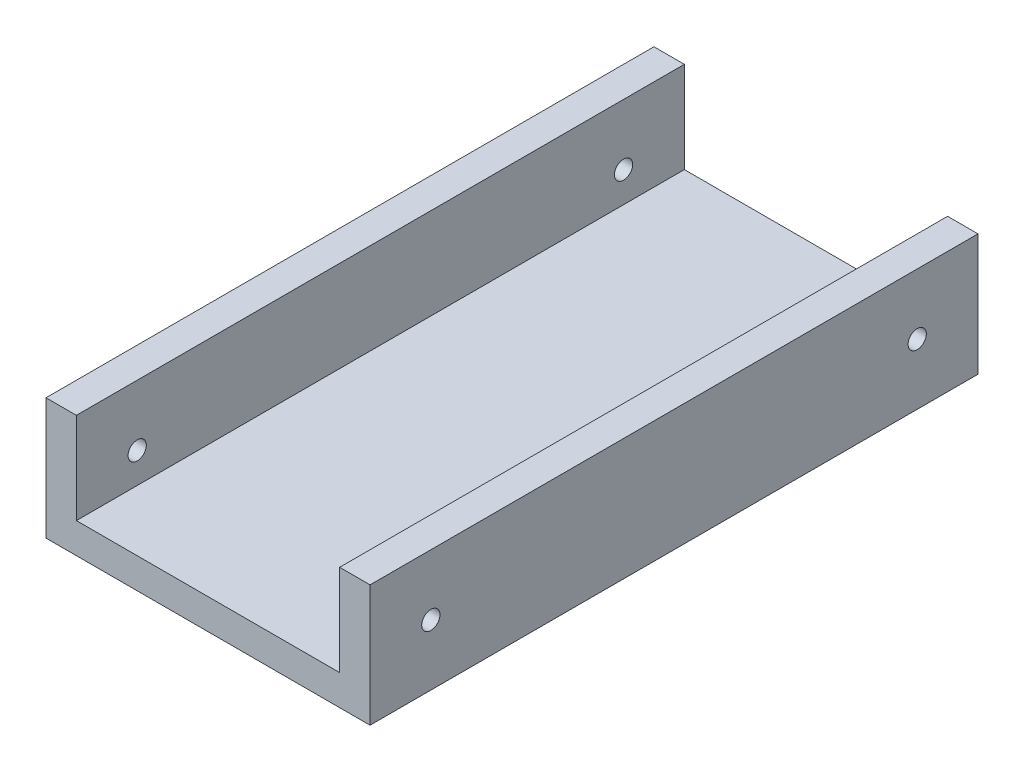
ISO-10303-21;
HEADER;
FILE_DESCRIPTION(('STEP AP214'),'2;1');
FILE_NAME('part.step','',(''),(''),'','','');
FILE_SCHEMA(('AUTOMOTIVE_DESIGN { 1 0 10303 214 1 1 1 1 }'));
ENDSEC;
DATA;
#1=APPLICATION_CONTEXT('core data for automotive mechanical design processes');
#2=APPLICATION_PROTOCOL_DEFINITION('international standard','automotive_design',2000,#1);
#3=PRODUCT_CONTEXT('',#1,'mechanical');
#4=PRODUCT('Part','Part','',(#3));
#5=PRODUCT_RELATED_PRODUCT_CATEGORY('part','',(#4));
#6=PRODUCT_DEFINITION_FORMATION('','',#4);
#7=PRODUCT_DEFINITION_CONTEXT('part definition',#1,'design');
#8=PRODUCT_DEFINITION('design','',#6,#7);
#9=PRODUCT_DEFINITION_SHAPE('','',#8);
#10=(LENGTH_UNIT() NAMED_UNIT(*) SI_UNIT(.MILLI.,.METRE.));
#11=(NAMED_UNIT(*) PLANE_ANGLE_UNIT() SI_UNIT($,.RADIAN.));
#12=(NAMED_UNIT(*) SI_UNIT($,.STERADIAN.) SOLID_ANGLE_UNIT());
#13=UNCERTAINTY_MEASURE_WITH_UNIT(LENGTH_MEASURE(1.E-05),#10,'distance_accuracy_value','');
#14=(GEOMETRIC_REPRESENTATION_CONTEXT(3) GLOBAL_UNCERTAINTY_ASSIGNED_CONTEXT((#13)) GLOBAL_UNIT_ASSIGNED_CONTEXT((#10,
#11,#12)) REPRESENTATION_CONTEXT('',''));
#15=CARTESIAN_POINT('',(0.,0.,0.));
#16=DIRECTION('',(0.,0.,1.));
#17=DIRECTION('',(1.,0.,0.));
#18=AXIS2_PLACEMENT_3D('',#15,#16,#17);
#19=CARTESIAN_POINT('',(0.,20.,0.));
#20=DIRECTION('',(0.,1.,0.));
#21=DIRECTION('',(0.,0.,1.));
#22=AXIS2_PLACEMENT_3D('',#19,#20,#21);
#23=PLANE('',#22);
#24=DIRECTION('',(0.,0.,1.));
#25=VECTOR('',#24,1.);
#26=CARTESIAN_POINT('',(5.,20.,0.));
#27=LINE('',#26,#25);
#28=CARTESIAN_POINT('',(5.,20.,0.));
#29=VERTEX_POINT('',#28);
#30=CARTESIAN_POINT('',(5.00000000000001,20.,100.));
#31=VERTEX_POINT('',#30);
#32=EDGE_CURVE('E122',#29,#31,#27,.T.);
#33=ORIENTED_EDGE('',*,*,#32,.F.);
#34=DIRECTION('',(-1.,0.,0.));
#35=VECTOR('',#34,1.);
#36=CARTESIAN_POINT('',(0.,20.,0.));
#37=LINE('',#36,#35);
#38=CARTESIAN_POINT('',(0.,20.,0.));
#39=VERTEX_POINT('',#38);
#40=EDGE_CURVE('E67',#29,#39,#37,.T.);
#41=ORIENTED_EDGE('',*,*,#40,.T.);
#42=DIRECTION('',(0.,0.,1.));
#43=VECTOR('',#42,1.);
#44=CARTESIAN_POINT('',(0.,20.,0.));
#45=LINE('',#44,#43);
#46=CARTESIAN_POINT('',(0.,20.,100.));
#47=VERTEX_POINT('',#46);
#48=EDGE_CURVE('E153',#39,#47,#45,.T.);
#49=ORIENTED_EDGE('',*,*,#48,.T.);
#50=DIRECTION('',(1.,0.,0.));
#51=VECTOR('',#50,1.);
#52=CARTESIAN_POINT('',(0.,20.,100.));
#53=LINE('',#52,#51);
#54=EDGE_CURVE('E96',#47,#31,#53,.T.);
#55=ORIENTED_EDGE('',*,*,#54,.T.);
#56=EDGE_LOOP('',(#33,#41,#49,#55));
#57=FACE_BOUND('',#56,.T.);
#58=ADVANCED_FACE('F41',(#57),#23,.T.);
#59=CARTESIAN_POINT('',(0.,20.,0.));
#60=DIRECTION('',(1.,0.,0.));
#61=DIRECTION('',(0.,0.,-1.));
#62=AXIS2_PLACEMENT_3D('',#59,#60,#61);
#63=PLANE('',#62);
#64=CARTESIAN_POINT('',(0.,10.,90.0000000000001));
#65=DIRECTION('',(1.,0.,0.));
#66=DIRECTION('',(0.,0.,-1.));
#67=AXIS2_PLACEMENT_3D('',#64,#65,#66);
#68=CIRCLE('',#67,1.5);
#69=CARTESIAN_POINT('',(0.,10.,88.5000000000001));
#70=VERTEX_POINT('',#69);
#71=EDGE_CURVE('E177',#70,#70,#68,.T.);
#72=ORIENTED_EDGE('',*,*,#71,.T.);
#73=EDGE_LOOP('',(#72));
#74=FACE_BOUND('',#73,.T.);
#75=CARTESIAN_POINT('',(0.,10.,10.));
#76=DIRECTION('',(1.,0.,0.));
#77=DIRECTION('',(0.,0.,1.));
#78=AXIS2_PLACEMENT_3D('',#75,#76,#77);
#79=CIRCLE('',#78,1.5);
#80=CARTESIAN_POINT('',(0.,10.,11.5));
#81=VERTEX_POINT('',#80);
#82=EDGE_CURVE('E193',#81,#81,#79,.T.);
#83=ORIENTED_EDGE('',*,*,#82,.T.);
#84=EDGE_LOOP('',(#83));
#85=FACE_BOUND('',#84,.T.);
#86=DIRECTION('',(0.,0.,1.));
#87=VECTOR('',#86,1.);
#88=CARTESIAN_POINT('',(0.,0.,0.));
#89=LINE('',#88,#87);
#90=CARTESIAN_POINT('',(0.,0.,0.));
#91=VERTEX_POINT('',#90);
#92=CARTESIAN_POINT('',(0.,0.,100.));
#93=VERTEX_POINT('',#92);
#94=EDGE_CURVE('E148',#91,#93,#89,.T.);
#95=ORIENTED_EDGE('',*,*,#94,.T.);
#96=DIRECTION('',(0.,-1.,0.));
#97=VECTOR('',#96,1.);
#98=CARTESIAN_POINT('',(0.,20.,100.));
#99=LINE('',#98,#97);
#100=EDGE_CURVE('E11',#47,#93,#99,.T.);
#101=ORIENTED_EDGE('',*,*,#100,.F.);
#102=ORIENTED_EDGE('',*,*,#48,.F.);
#103=DIRECTION('',(0.,-1.,0.));
#104=VECTOR('',#103,1.);
#105=CARTESIAN_POINT('',(0.,20.,0.));
#106=LINE('',#105,#104);
#107=EDGE_CURVE('E162',#39,#91,#106,.T.);
#108=ORIENTED_EDGE('',*,*,#107,.T.);
#109=EDGE_LOOP('',(#95,#101,#102,#108));
#110=FACE_BOUND('',#109,.T.);
#111=ADVANCED_FACE('F43',(#74,#85,#110),#63,.F.);
#112=CARTESIAN_POINT('',(0.,20.,100.));
#113=DIRECTION('',(0.,0.,-1.));
#114=DIRECTION('',(-1.,0.,0.));
#115=AXIS2_PLACEMENT_3D('',#112,#113,#114);
#116=PLANE('',#115);
#117=DIRECTION('',(1.,0.,0.));
#118=VECTOR('',#117,1.);
#119=CARTESIAN_POINT('',(5.00000000000001,5.,100.));
#120=LINE('',#119,#118);
#121=CARTESIAN_POINT('',(5.00000000000001,5.,100.));
#122=VERTEX_POINT('',#121);
#123=CARTESIAN_POINT('',(48.3,5.,100.));
#124=VERTEX_POINT('',#123);
#125=EDGE_CURVE('E130',#122,#124,#120,.T.);
#126=ORIENTED_EDGE('',*,*,#125,.F.);
#127=DIRECTION('',(0.,1.,0.));
#128=VECTOR('',#127,1.);
#129=CARTESIAN_POINT('',(5.00000000000001,5.,100.));
#130=LINE('',#129,#128);
#131=EDGE_CURVE('E117',#122,#31,#130,.T.);
#132=ORIENTED_EDGE('',*,*,#131,.T.);
#133=ORIENTED_EDGE('',*,*,#54,.F.);
#134=ORIENTED_EDGE('',*,*,#100,.T.);
#135=DIRECTION('',(1.,0.,0.));
#136=VECTOR('',#135,1.);
#137=CARTESIAN_POINT('',(0.,0.,100.));
#138=LINE('',#137,#136);
#139=CARTESIAN_POINT('',(53.3,0.,100.));
#140=VERTEX_POINT('',#139);
#141=EDGE_CURVE('E165',#93,#140,#138,.T.);
#142=ORIENTED_EDGE('',*,*,#141,.T.);
#143=DIRECTION('',(0.,-1.,0.));
#144=VECTOR('',#143,1.);
#145=CARTESIAN_POINT('',(53.3,20.,100.));
#146=LINE('',#145,#144);
#147=CARTESIAN_POINT('',(53.3,20.,100.));
#148=VERTEX_POINT('',#147);
#149=EDGE_CURVE('E50',#148,#140,#146,.T.);
#150=ORIENTED_EDGE('',*,*,#149,.F.);
#151=CARTESIAN_POINT('',(48.3,20.,100.));
#152=VERTEX_POINT('',#151);
#153=EDGE_CURVE('E155',#152,#148,#53,.T.);
#154=ORIENTED_EDGE('',*,*,#153,.F.);
#155=DIRECTION('',(0.,1.,0.));
#156=VECTOR('',#155,1.);
#157=CARTESIAN_POINT('',(48.3,5.,100.));
#158=LINE('',#157,#156);
#159=EDGE_CURVE('E58',#124,#152,#158,.T.);
#160=ORIENTED_EDGE('',*,*,#159,.F.);
#161=EDGE_LOOP('',(#126,#132,#133,#134,#142,#150,#154,#160));
#162=FACE_BOUND('',#161,.T.);
#163=ADVANCED_FACE('F135',(#162),#116,.F.);
#164=CARTESIAN_POINT('',(53.3,20.,0.));
#165=DIRECTION('',(-1.,0.,0.));
#166=DIRECTION('',(0.,0.,1.));
#167=AXIS2_PLACEMENT_3D('',#164,#165,#166);
#168=PLANE('',#167);
#169=CARTESIAN_POINT('',(53.3,10.,90.));
#170=DIRECTION('',(1.,0.,0.));
#171=DIRECTION('',(0.,0.,-1.));
#172=AXIS2_PLACEMENT_3D('',#169,#170,#171);
#173=CIRCLE('',#172,1.5);
#174=CARTESIAN_POINT('',(53.3,10.,88.5));
#175=VERTEX_POINT('',#174);
#176=EDGE_CURVE('E183',#175,#175,#173,.T.);
#177=ORIENTED_EDGE('',*,*,#176,.F.);
#178=EDGE_LOOP('',(#177));
#179=FACE_BOUND('',#178,.T.);
#180=CARTESIAN_POINT('',(53.3,10.,10.));
#181=DIRECTION('',(1.,0.,0.));
#182=DIRECTION('',(0.,0.,1.));
#183=AXIS2_PLACEMENT_3D('',#180,#181,#182);
#184=CIRCLE('',#183,1.5);
#185=CARTESIAN_POINT('',(53.3,10.,11.5));
#186=VERTEX_POINT('',#185);
#187=EDGE_CURVE('E188',#186,#186,#184,.T.);
#188=ORIENTED_EDGE('',*,*,#187,.F.);
#189=EDGE_LOOP('',(#188));
#190=FACE_BOUND('',#189,.T.);
#191=DIRECTION('',(0.,0.,-1.));
#192=VECTOR('',#191,1.);
#193=CARTESIAN_POINT('',(53.3,0.,0.));
#194=LINE('',#193,#192);
#195=CARTESIAN_POINT('',(53.3,0.,0.));
#196=VERTEX_POINT('',#195);
#197=EDGE_CURVE('E167',#140,#196,#194,.T.);
#198=ORIENTED_EDGE('',*,*,#197,.T.);
#199=DIRECTION('',(0.,-1.,0.));
#200=VECTOR('',#199,1.);
#201=CARTESIAN_POINT('',(53.3,20.,0.));
#202=LINE('',#201,#200);
#203=CARTESIAN_POINT('',(53.3,20.,0.));
#204=VERTEX_POINT('',#203);
#205=EDGE_CURVE('E171',#204,#196,#202,.T.);
#206=ORIENTED_EDGE('',*,*,#205,.F.);
#207=DIRECTION('',(0.,0.,-1.));
#208=VECTOR('',#207,1.);
#209=CARTESIAN_POINT('',(53.3,20.,0.));
#210=LINE('',#209,#208);
#211=EDGE_CURVE('E157',#148,#204,#210,.T.);
#212=ORIENTED_EDGE('',*,*,#211,.F.);
#213=ORIENTED_EDGE('',*,*,#149,.T.);
#214=EDGE_LOOP('',(#198,#206,#212,#213));
#215=FACE_BOUND('',#214,.T.);
#216=ADVANCED_FACE('F238',(#179,#190,#215),#168,.F.);
#217=CARTESIAN_POINT('',(0.,20.,0.));
#218=DIRECTION('',(0.,0.,1.));
#219=DIRECTION('',(1.,0.,0.));
#220=AXIS2_PLACEMENT_3D('',#217,#218,#219);
#221=PLANE('',#220);
#222=ORIENTED_EDGE('',*,*,#40,.F.);
#223=DIRECTION('',(0.,1.,0.));
#224=VECTOR('',#223,1.);
#225=CARTESIAN_POINT('',(5.,5.,0.));
#226=LINE('',#225,#224);
#227=CARTESIAN_POINT('',(5.,5.,0.));
#228=VERTEX_POINT('',#227);
#229=EDGE_CURVE('E146',#228,#29,#226,.T.);
#230=ORIENTED_EDGE('',*,*,#229,.F.);
#231=DIRECTION('',(-1.,0.,0.));
#232=VECTOR('',#231,1.);
#233=CARTESIAN_POINT('',(5.,5.,0.));
#234=LINE('',#233,#232);
#235=CARTESIAN_POINT('',(48.3,5.,0.));
#236=VERTEX_POINT('',#235);
#237=EDGE_CURVE('E124',#236,#228,#234,.T.);
#238=ORIENTED_EDGE('',*,*,#237,.F.);
#239=DIRECTION('',(0.,1.,0.));
#240=VECTOR('',#239,1.);
#241=CARTESIAN_POINT('',(48.3,5.,0.));
#242=LINE('',#241,#240);
#243=CARTESIAN_POINT('',(48.3,20.,0.));
#244=VERTEX_POINT('',#243);
#245=EDGE_CURVE('E149',#236,#244,#242,.T.);
#246=ORIENTED_EDGE('',*,*,#245,.T.);
#247=EDGE_CURVE('E159',#204,#244,#37,.T.);
#248=ORIENTED_EDGE('',*,*,#247,.F.);
#249=ORIENTED_EDGE('',*,*,#205,.T.);
#250=DIRECTION('',(-1.,0.,0.));
#251=VECTOR('',#250,1.);
#252=CARTESIAN_POINT('',(0.,0.,0.));
#253=LINE('',#252,#251);
#254=EDGE_CURVE('E89',#196,#91,#253,.T.);
#255=ORIENTED_EDGE('',*,*,#254,.T.);
#256=ORIENTED_EDGE('',*,*,#107,.F.);
#257=EDGE_LOOP('',(#222,#230,#238,#246,#248,#249,#255,#256));
#258=FACE_BOUND('',#257,.T.);
#259=ADVANCED_FACE('F231',(#258),#221,.F.);
#260=DIRECTION('',(0.,0.,-1.));
#261=VECTOR('',#260,1.);
#262=CARTESIAN_POINT('',(48.3,20.,0.));
#263=LINE('',#262,#261);
#264=EDGE_CURVE('E133',#152,#244,#263,.T.);
#265=ORIENTED_EDGE('',*,*,#264,.F.);
#266=ORIENTED_EDGE('',*,*,#153,.T.);
#267=ORIENTED_EDGE('',*,*,#211,.T.);
#268=ORIENTED_EDGE('',*,*,#247,.T.);
#269=EDGE_LOOP('',(#265,#266,#267,#268));
#270=FACE_BOUND('',#269,.T.);
#271=ADVANCED_FACE('F221',(#270),#23,.T.);
#272=CARTESIAN_POINT('',(0.,0.,0.));
#273=DIRECTION('',(0.,1.,0.));
#274=DIRECTION('',(0.,0.,1.));
#275=AXIS2_PLACEMENT_3D('',#272,#273,#274);
#276=PLANE('',#275);
#277=ORIENTED_EDGE('',*,*,#94,.F.);
#278=ORIENTED_EDGE('',*,*,#254,.F.);
#279=ORIENTED_EDGE('',*,*,#197,.F.);
#280=ORIENTED_EDGE('',*,*,#141,.F.);
#281=EDGE_LOOP('',(#277,#278,#279,#280));
#282=FACE_BOUND('',#281,.T.);
#283=ADVANCED_FACE('F230',(#282),#276,.F.);
#284=CARTESIAN_POINT('',(5.,5.,0.));
#285=DIRECTION('',(-1.,0.,0.));
#286=DIRECTION('',(0.,0.,1.));
#287=AXIS2_PLACEMENT_3D('',#284,#285,#286);
#288=PLANE('',#287);
#289=CARTESIAN_POINT('',(5.00000000000001,10.,90.0000000000001));
#290=DIRECTION('',(-1.,0.,0.));
#291=DIRECTION('',(0.,0.,1.));
#292=AXIS2_PLACEMENT_3D('',#289,#290,#291);
#293=CIRCLE('',#292,1.5);
#294=CARTESIAN_POINT('',(5.00000000000001,10.,91.5000000000001));
#295=VERTEX_POINT('',#294);
#296=EDGE_CURVE('E144',#295,#295,#293,.T.);
#297=ORIENTED_EDGE('',*,*,#296,.T.);
#298=EDGE_LOOP('',(#297));
#299=FACE_BOUND('',#298,.T.);
#300=CARTESIAN_POINT('',(5.,10.,10.));
#301=DIRECTION('',(-1.,0.,0.));
#302=DIRECTION('',(0.,0.,1.));
#303=AXIS2_PLACEMENT_3D('',#300,#301,#302);
#304=CIRCLE('',#303,1.5);
#305=CARTESIAN_POINT('',(5.,10.,11.5));
#306=VERTEX_POINT('',#305);
#307=EDGE_CURVE('E176',#306,#306,#304,.T.);
#308=ORIENTED_EDGE('',*,*,#307,.T.);
#309=EDGE_LOOP('',(#308));
#310=FACE_BOUND('',#309,.T.);
#311=ORIENTED_EDGE('',*,*,#32,.T.);
#312=ORIENTED_EDGE('',*,*,#131,.F.);
#313=DIRECTION('',(0.,0.,1.));
#314=VECTOR('',#313,1.);
#315=CARTESIAN_POINT('',(5.,5.,0.));
#316=LINE('',#315,#314);
#317=EDGE_CURVE('E120',#228,#122,#316,.T.);
#318=ORIENTED_EDGE('',*,*,#317,.F.);
#319=ORIENTED_EDGE('',*,*,#229,.T.);
#320=EDGE_LOOP('',(#311,#312,#318,#319));
#321=FACE_BOUND('',#320,.T.);
#322=ADVANCED_FACE('F119',(#299,#310,#321),#288,.F.);
#323=CARTESIAN_POINT('',(48.3,5.,0.));
#324=DIRECTION('',(1.,0.,0.));
#325=DIRECTION('',(0.,0.,-1.));
#326=AXIS2_PLACEMENT_3D('',#323,#324,#325);
#327=PLANE('',#326);
#328=CARTESIAN_POINT('',(48.3,10.,90.));
#329=DIRECTION('',(1.,0.,0.));
#330=DIRECTION('',(0.,0.,-1.));
#331=AXIS2_PLACEMENT_3D('',#328,#329,#330);
#332=CIRCLE('',#331,1.5);
#333=CARTESIAN_POINT('',(48.3,10.,88.5));
#334=VERTEX_POINT('',#333);
#335=EDGE_CURVE('E45',#334,#334,#332,.T.);
#336=ORIENTED_EDGE('',*,*,#335,.T.);
#337=EDGE_LOOP('',(#336));
#338=FACE_BOUND('',#337,.T.);
#339=CARTESIAN_POINT('',(48.3,10.,10.));
#340=DIRECTION('',(1.,0.,0.));
#341=DIRECTION('',(0.,0.,-1.));
#342=AXIS2_PLACEMENT_3D('',#339,#340,#341);
#343=CIRCLE('',#342,1.5);
#344=CARTESIAN_POINT('',(48.3,10.,8.50000000000001));
#345=VERTEX_POINT('',#344);
#346=EDGE_CURVE('E174',#345,#345,#343,.T.);
#347=ORIENTED_EDGE('',*,*,#346,.T.);
#348=EDGE_LOOP('',(#347));
#349=FACE_BOUND('',#348,.T.);
#350=ORIENTED_EDGE('',*,*,#264,.T.);
#351=ORIENTED_EDGE('',*,*,#245,.F.);
#352=DIRECTION('',(0.,0.,-1.));
#353=VECTOR('',#352,1.);
#354=CARTESIAN_POINT('',(48.3,5.,0.));
#355=LINE('',#354,#353);
#356=EDGE_CURVE('E137',#124,#236,#355,.T.);
#357=ORIENTED_EDGE('',*,*,#356,.F.);
#358=ORIENTED_EDGE('',*,*,#159,.T.);
#359=EDGE_LOOP('',(#350,#351,#357,#358));
#360=FACE_BOUND('',#359,.T.);
#361=ADVANCED_FACE('F201',(#338,#349,#360),#327,.F.);
#362=CARTESIAN_POINT('',(0.,5.,0.));
#363=DIRECTION('',(0.,1.,0.));
#364=DIRECTION('',(0.,0.,1.));
#365=AXIS2_PLACEMENT_3D('',#362,#363,#364);
#366=PLANE('',#365);
#367=ORIENTED_EDGE('',*,*,#317,.T.);
#368=ORIENTED_EDGE('',*,*,#125,.T.);
#369=ORIENTED_EDGE('',*,*,#356,.T.);
#370=ORIENTED_EDGE('',*,*,#237,.T.);
#371=EDGE_LOOP('',(#367,#368,#369,#370));
#372=FACE_BOUND('',#371,.T.);
#373=ADVANCED_FACE('F128',(#372),#366,.T.);
#374=CARTESIAN_POINT('',(0.,10.,10.));
#375=DIRECTION('',(1.,0.,0.));
#376=DIRECTION('',(0.,0.,-1.));
#377=AXIS2_PLACEMENT_3D('',#374,#375,#376);
#378=CYLINDRICAL_SURFACE('',#377,1.5);
#379=ORIENTED_EDGE('',*,*,#187,.T.);
#380=EDGE_LOOP('',(#379));
#381=FACE_BOUND('',#380,.T.);
#382=ORIENTED_EDGE('',*,*,#346,.F.);
#383=EDGE_LOOP('',(#382));
#384=FACE_BOUND('',#383,.T.);
#385=ADVANCED_FACE('F206',(#381,#384),#378,.F.);
#386=CARTESIAN_POINT('',(0.,10.,90.0000000000001));
#387=DIRECTION('',(1.,0.,0.));
#388=DIRECTION('',(0.,0.,-1.));
#389=AXIS2_PLACEMENT_3D('',#386,#387,#388);
#390=CYLINDRICAL_SURFACE('',#389,1.5);
#391=ORIENTED_EDGE('',*,*,#176,.T.);
#392=EDGE_LOOP('',(#391));
#393=FACE_BOUND('',#392,.T.);
#394=ORIENTED_EDGE('',*,*,#335,.F.);
#395=EDGE_LOOP('',(#394));
#396=FACE_BOUND('',#395,.T.);
#397=ADVANCED_FACE('F203',(#393,#396),#390,.F.);
#398=ORIENTED_EDGE('',*,*,#82,.F.);
#399=EDGE_LOOP('',(#398));
#400=FACE_BOUND('',#399,.T.);
#401=ORIENTED_EDGE('',*,*,#307,.F.);
#402=EDGE_LOOP('',(#401));
#403=FACE_BOUND('',#402,.T.);
#404=ADVANCED_FACE('F205',(#400,#403),#378,.F.);
#405=ORIENTED_EDGE('',*,*,#71,.F.);
#406=EDGE_LOOP('',(#405));
#407=FACE_BOUND('',#406,.T.);
#408=ORIENTED_EDGE('',*,*,#296,.F.);
#409=EDGE_LOOP('',(#408));
#410=FACE_BOUND('',#409,.T.);
#411=ADVANCED_FACE('F209',(#407,#410),#390,.F.);
#412=CLOSED_SHELL('',(#58,#111,#163,#216,#259,#271,#283,#322,#361,#373,#385,#397,#404,#411));
#413=MANIFOLD_SOLID_BREP('B2',#412);
#414=ADVANCED_BREP_SHAPE_REPRESENTATION('',(#18,#413),#14);
#415=SHAPE_DEFINITION_REPRESENTATION(#9,#414);
ENDSEC;
END-ISO-10303-21;
